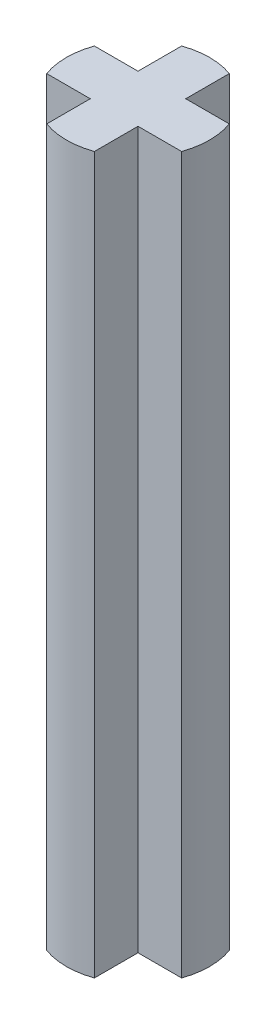
ISO-10303-21;
HEADER;
FILE_DESCRIPTION(('STEP AP214'),'2;1');
FILE_NAME('part.step','',(''),(''),'','','');
FILE_SCHEMA(('AUTOMOTIVE_DESIGN { 1 0 10303 214 1 1 1 1 }'));
ENDSEC;
DATA;
#1=APPLICATION_CONTEXT('core data for automotive mechanical design processes');
#2=APPLICATION_PROTOCOL_DEFINITION('international standard','automotive_design',2000,#1);
#3=PRODUCT_CONTEXT('',#1,'mechanical');
#4=PRODUCT('Part','Part','',(#3));
#5=PRODUCT_RELATED_PRODUCT_CATEGORY('part','',(#4));
#6=PRODUCT_DEFINITION_FORMATION('','',#4);
#7=PRODUCT_DEFINITION_CONTEXT('part definition',#1,'design');
#8=PRODUCT_DEFINITION('design','',#6,#7);
#9=PRODUCT_DEFINITION_SHAPE('','',#8);
#10=(LENGTH_UNIT() NAMED_UNIT(*) SI_UNIT(.MILLI.,.METRE.));
#11=(NAMED_UNIT(*) PLANE_ANGLE_UNIT() SI_UNIT($,.RADIAN.));
#12=(NAMED_UNIT(*) SI_UNIT($,.STERADIAN.) SOLID_ANGLE_UNIT());
#13=UNCERTAINTY_MEASURE_WITH_UNIT(LENGTH_MEASURE(1.E-05),#10,'distance_accuracy_value','');
#14=(GEOMETRIC_REPRESENTATION_CONTEXT(3) GLOBAL_UNCERTAINTY_ASSIGNED_CONTEXT((#13)) GLOBAL_UNIT_ASSIGNED_CONTEXT((#10,
#11,#12)) REPRESENTATION_CONTEXT('',''));
#15=CARTESIAN_POINT('',(0.,0.,0.));
#16=DIRECTION('',(0.,0.,1.));
#17=DIRECTION('',(1.,0.,0.));
#18=AXIS2_PLACEMENT_3D('',#15,#16,#17);
#19=CARTESIAN_POINT('',(-1.5,15.,0.5));
#20=DIRECTION('',(0.,0.,-1.));
#21=DIRECTION('',(-1.,0.,0.));
#22=AXIS2_PLACEMENT_3D('',#19,#20,#21);
#23=PLANE('',#22);
#24=DIRECTION('',(0.,1.,0.));
#25=VECTOR('',#24,1.);
#26=CARTESIAN_POINT('',(-1.41421356237309,-0.000999999999999265,0.5));
#27=LINE('',#26,#25);
#28=CARTESIAN_POINT('',(-1.4142135623731,15.,0.5));
#29=VERTEX_POINT('',#28);
#30=CARTESIAN_POINT('',(-1.4142135623731,0.,0.5));
#31=VERTEX_POINT('',#30);
#32=EDGE_CURVE('E243',#29,#31,#27,.F.);
#33=ORIENTED_EDGE('',*,*,#32,.T.);
#34=DIRECTION('',(1.,0.,0.));
#35=VECTOR('',#34,1.);
#36=CARTESIAN_POINT('',(-1.5,0.,0.5));
#37=LINE('',#36,#35);
#38=CARTESIAN_POINT('',(-0.5,0.,0.5));
#39=VERTEX_POINT('',#38);
#40=EDGE_CURVE('E211',#31,#39,#37,.T.);
#41=ORIENTED_EDGE('',*,*,#40,.T.);
#42=DIRECTION('',(0.,1.,0.));
#43=VECTOR('',#42,1.);
#44=CARTESIAN_POINT('',(-0.5,15.,0.5));
#45=LINE('',#44,#43);
#46=CARTESIAN_POINT('',(-0.5,15.,0.5));
#47=VERTEX_POINT('',#46);
#48=EDGE_CURVE('E65',#39,#47,#45,.T.);
#49=ORIENTED_EDGE('',*,*,#48,.T.);
#50=DIRECTION('',(1.,0.,0.));
#51=VECTOR('',#50,1.);
#52=CARTESIAN_POINT('',(-1.5,15.,0.5));
#53=LINE('',#52,#51);
#54=EDGE_CURVE('E206',#29,#47,#53,.T.);
#55=ORIENTED_EDGE('',*,*,#54,.F.);
#56=EDGE_LOOP('',(#33,#41,#49,#55));
#57=FACE_BOUND('',#56,.T.);
#58=ADVANCED_FACE('F57',(#57),#23,.F.);
#59=CARTESIAN_POINT('',(-1.5,15.,-0.5));
#60=DIRECTION('',(0.,0.,-1.));
#61=DIRECTION('',(-1.,0.,0.));
#62=AXIS2_PLACEMENT_3D('',#59,#60,#61);
#63=PLANE('',#62);
#64=DIRECTION('',(1.,0.,0.));
#65=VECTOR('',#64,1.);
#66=CARTESIAN_POINT('',(-1.5,0.,-0.5));
#67=LINE('',#66,#65);
#68=CARTESIAN_POINT('',(-1.4142135623731,0.,-0.5));
#69=VERTEX_POINT('',#68);
#70=CARTESIAN_POINT('',(-0.5,0.,-0.5));
#71=VERTEX_POINT('',#70);
#72=EDGE_CURVE('E214',#69,#71,#67,.T.);
#73=ORIENTED_EDGE('',*,*,#72,.F.);
#74=DIRECTION('',(0.,1.,0.));
#75=VECTOR('',#74,1.);
#76=CARTESIAN_POINT('',(-1.41421356237309,-0.000999999999999265,-0.5));
#77=LINE('',#76,#75);
#78=CARTESIAN_POINT('',(-1.4142135623731,15.,-0.5));
#79=VERTEX_POINT('',#78);
#80=EDGE_CURVE('E240',#79,#69,#77,.F.);
#81=ORIENTED_EDGE('',*,*,#80,.F.);
#82=DIRECTION('',(1.,0.,0.));
#83=VECTOR('',#82,1.);
#84=CARTESIAN_POINT('',(-1.5,15.,-0.5));
#85=LINE('',#84,#83);
#86=CARTESIAN_POINT('',(-0.5,15.,-0.5));
#87=VERTEX_POINT('',#86);
#88=EDGE_CURVE('E187',#79,#87,#85,.T.);
#89=ORIENTED_EDGE('',*,*,#88,.T.);
#90=DIRECTION('',(0.,1.,0.));
#91=VECTOR('',#90,1.);
#92=CARTESIAN_POINT('',(-0.5,15.,-0.5));
#93=LINE('',#92,#91);
#94=EDGE_CURVE('E183',#71,#87,#93,.T.);
#95=ORIENTED_EDGE('',*,*,#94,.F.);
#96=EDGE_LOOP('',(#73,#81,#89,#95));
#97=FACE_BOUND('',#96,.T.);
#98=ADVANCED_FACE('F259',(#97),#63,.T.);
#99=CARTESIAN_POINT('',(0.,0.,0.));
#100=DIRECTION('',(0.,1.,0.));
#101=DIRECTION('',(0.,0.,1.));
#102=AXIS2_PLACEMENT_3D('',#99,#100,#101);
#103=PLANE('',#102);
#104=CARTESIAN_POINT('',(0.,0.,0.));
#105=DIRECTION('',(0.,1.,0.));
#106=DIRECTION('',(0.,0.,1.));
#107=AXIS2_PLACEMENT_3D('',#104,#105,#106);
#108=CIRCLE('',#107,1.5);
#109=EDGE_CURVE('E162',#31,#69,#108,.F.);
#110=ORIENTED_EDGE('',*,*,#109,.T.);
#111=ORIENTED_EDGE('',*,*,#72,.T.);
#112=DIRECTION('',(0.,0.,-1.));
#113=VECTOR('',#112,1.);
#114=CARTESIAN_POINT('',(-0.5,0.,1.5));
#115=LINE('',#114,#113);
#116=CARTESIAN_POINT('',(-0.5,0.,-1.4142135623731));
#117=VERTEX_POINT('',#116);
#118=EDGE_CURVE('E174',#71,#117,#115,.T.);
#119=ORIENTED_EDGE('',*,*,#118,.T.);
#120=CARTESIAN_POINT('',(0.5,0.,-1.41421356237309));
#121=VERTEX_POINT('',#120);
#122=EDGE_CURVE('E159',#117,#121,#108,.F.);
#123=ORIENTED_EDGE('',*,*,#122,.T.);
#124=DIRECTION('',(0.,0.,-1.));
#125=VECTOR('',#124,1.);
#126=CARTESIAN_POINT('',(0.5,0.,1.5));
#127=LINE('',#126,#125);
#128=CARTESIAN_POINT('',(0.5,0.,-0.5));
#129=VERTEX_POINT('',#128);
#130=EDGE_CURVE('E253',#129,#121,#127,.T.);
#131=ORIENTED_EDGE('',*,*,#130,.F.);
#132=CARTESIAN_POINT('',(1.41421356237309,0.,-0.5));
#133=VERTEX_POINT('',#132);
#134=EDGE_CURVE('E196',#129,#133,#67,.T.);
#135=ORIENTED_EDGE('',*,*,#134,.T.);
#136=CARTESIAN_POINT('',(1.41421356237309,0.,0.5));
#137=VERTEX_POINT('',#136);
#138=EDGE_CURVE('E80',#133,#137,#108,.F.);
#139=ORIENTED_EDGE('',*,*,#138,.T.);
#140=CARTESIAN_POINT('',(0.5,0.,0.5));
#141=VERTEX_POINT('',#140);
#142=EDGE_CURVE('E213',#141,#137,#37,.T.);
#143=ORIENTED_EDGE('',*,*,#142,.F.);
#144=CARTESIAN_POINT('',(0.5,0.,1.41421356237309));
#145=VERTEX_POINT('',#144);
#146=EDGE_CURVE('E155',#145,#141,#127,.T.);
#147=ORIENTED_EDGE('',*,*,#146,.F.);
#148=CARTESIAN_POINT('',(-0.5,0.,1.4142135623731));
#149=VERTEX_POINT('',#148);
#150=EDGE_CURVE('E147',#145,#149,#108,.F.);
#151=ORIENTED_EDGE('',*,*,#150,.T.);
#152=EDGE_CURVE('E152',#149,#39,#115,.T.);
#153=ORIENTED_EDGE('',*,*,#152,.T.);
#154=ORIENTED_EDGE('',*,*,#40,.F.);
#155=EDGE_LOOP('',(#110,#111,#119,#123,#131,#135,#139,#143,#147,#151,#153,#154));
#156=FACE_BOUND('',#155,.T.);
#157=ADVANCED_FACE('F149',(#156),#103,.F.);
#158=CARTESIAN_POINT('',(0.,15.,0.));
#159=DIRECTION('',(0.,1.,0.));
#160=DIRECTION('',(0.,0.,1.));
#161=AXIS2_PLACEMENT_3D('',#158,#159,#160);
#162=PLANE('',#161);
#163=ORIENTED_EDGE('',*,*,#88,.F.);
#164=CARTESIAN_POINT('',(0.,15.,0.));
#165=DIRECTION('',(0.,1.,0.));
#166=DIRECTION('',(0.,0.,1.));
#167=AXIS2_PLACEMENT_3D('',#164,#165,#166);
#168=CIRCLE('',#167,1.5);
#169=EDGE_CURVE('E72',#79,#29,#168,.T.);
#170=ORIENTED_EDGE('',*,*,#169,.T.);
#171=ORIENTED_EDGE('',*,*,#54,.T.);
#172=DIRECTION('',(0.,0.,-1.));
#173=VECTOR('',#172,1.);
#174=CARTESIAN_POINT('',(-0.5,15.,1.5));
#175=LINE('',#174,#173);
#176=CARTESIAN_POINT('',(-0.5,15.,1.4142135623731));
#177=VERTEX_POINT('',#176);
#178=EDGE_CURVE('E216',#177,#47,#175,.T.);
#179=ORIENTED_EDGE('',*,*,#178,.F.);
#180=CARTESIAN_POINT('',(0.5,15.,1.4142135623731));
#181=VERTEX_POINT('',#180);
#182=EDGE_CURVE('E160',#177,#181,#168,.T.);
#183=ORIENTED_EDGE('',*,*,#182,.T.);
#184=DIRECTION('',(0.,0.,-1.));
#185=VECTOR('',#184,1.);
#186=CARTESIAN_POINT('',(0.5,15.,1.5));
#187=LINE('',#186,#185);
#188=CARTESIAN_POINT('',(0.5,15.,0.5));
#189=VERTEX_POINT('',#188);
#190=EDGE_CURVE('E177',#181,#189,#187,.T.);
#191=ORIENTED_EDGE('',*,*,#190,.T.);
#192=CARTESIAN_POINT('',(1.41421356237309,15.,0.5));
#193=VERTEX_POINT('',#192);
#194=EDGE_CURVE('E208',#189,#193,#53,.T.);
#195=ORIENTED_EDGE('',*,*,#194,.T.);
#196=CARTESIAN_POINT('',(1.41421356237309,15.,-0.5));
#197=VERTEX_POINT('',#196);
#198=EDGE_CURVE('E205',#193,#197,#168,.T.);
#199=ORIENTED_EDGE('',*,*,#198,.T.);
#200=CARTESIAN_POINT('',(0.5,15.,-0.5));
#201=VERTEX_POINT('',#200);
#202=EDGE_CURVE('E194',#201,#197,#85,.T.);
#203=ORIENTED_EDGE('',*,*,#202,.F.);
#204=CARTESIAN_POINT('',(0.5,15.,-1.4142135623731));
#205=VERTEX_POINT('',#204);
#206=EDGE_CURVE('E173',#201,#205,#187,.T.);
#207=ORIENTED_EDGE('',*,*,#206,.T.);
#208=CARTESIAN_POINT('',(-0.5,15.,-1.4142135623731));
#209=VERTEX_POINT('',#208);
#210=EDGE_CURVE('E227',#205,#209,#168,.T.);
#211=ORIENTED_EDGE('',*,*,#210,.T.);
#212=EDGE_CURVE('E215',#87,#209,#175,.T.);
#213=ORIENTED_EDGE('',*,*,#212,.F.);
#214=EDGE_LOOP('',(#163,#170,#171,#179,#183,#191,#195,#199,#203,#207,#211,#213));
#215=FACE_BOUND('',#214,.T.);
#216=ADVANCED_FACE('F203',(#215),#162,.T.);
#217=DIRECTION('',(0.,1.,0.));
#218=VECTOR('',#217,1.);
#219=CARTESIAN_POINT('',(1.41421356237309,-0.000999999999999265,0.5));
#220=LINE('',#219,#218);
#221=EDGE_CURVE('E237',#137,#193,#220,.T.);
#222=ORIENTED_EDGE('',*,*,#221,.T.);
#223=ORIENTED_EDGE('',*,*,#194,.F.);
#224=DIRECTION('',(0.,1.,0.));
#225=VECTOR('',#224,1.);
#226=CARTESIAN_POINT('',(0.5,15.,0.5));
#227=LINE('',#226,#225);
#228=EDGE_CURVE('E12',#141,#189,#227,.T.);
#229=ORIENTED_EDGE('',*,*,#228,.F.);
#230=ORIENTED_EDGE('',*,*,#142,.T.);
#231=EDGE_LOOP('',(#222,#223,#229,#230));
#232=FACE_BOUND('',#231,.T.);
#233=ADVANCED_FACE('F251',(#232),#23,.F.);
#234=ORIENTED_EDGE('',*,*,#202,.T.);
#235=DIRECTION('',(0.,1.,0.));
#236=VECTOR('',#235,1.);
#237=CARTESIAN_POINT('',(1.41421356237309,-0.000999999999999265,-0.5));
#238=LINE('',#237,#236);
#239=EDGE_CURVE('E232',#133,#197,#238,.T.);
#240=ORIENTED_EDGE('',*,*,#239,.F.);
#241=ORIENTED_EDGE('',*,*,#134,.F.);
#242=DIRECTION('',(0.,1.,0.));
#243=VECTOR('',#242,1.);
#244=CARTESIAN_POINT('',(0.5,15.,-0.5));
#245=LINE('',#244,#243);
#246=EDGE_CURVE('E186',#129,#201,#245,.T.);
#247=ORIENTED_EDGE('',*,*,#246,.T.);
#248=EDGE_LOOP('',(#234,#240,#241,#247));
#249=FACE_BOUND('',#248,.T.);
#250=ADVANCED_FACE('F192',(#249),#63,.T.);
#251=CARTESIAN_POINT('',(0.5,15.,1.5));
#252=DIRECTION('',(-1.,0.,0.));
#253=DIRECTION('',(0.,0.,1.));
#254=AXIS2_PLACEMENT_3D('',#251,#252,#253);
#255=PLANE('',#254);
#256=DIRECTION('',(0.,1.,0.));
#257=VECTOR('',#256,1.);
#258=CARTESIAN_POINT('',(0.5,-0.000999999999999265,-1.41421356237309));
#259=LINE('',#258,#257);
#260=EDGE_CURVE('E202',#121,#205,#259,.T.);
#261=ORIENTED_EDGE('',*,*,#260,.T.);
#262=ORIENTED_EDGE('',*,*,#206,.F.);
#263=ORIENTED_EDGE('',*,*,#246,.F.);
#264=ORIENTED_EDGE('',*,*,#130,.T.);
#265=EDGE_LOOP('',(#261,#262,#263,#264));
#266=FACE_BOUND('',#265,.T.);
#267=ADVANCED_FACE('F59',(#266),#255,.F.);
#268=CARTESIAN_POINT('',(-0.5,15.,1.5));
#269=DIRECTION('',(-1.,0.,0.));
#270=DIRECTION('',(0.,0.,1.));
#271=AXIS2_PLACEMENT_3D('',#268,#269,#270);
#272=PLANE('',#271);
#273=ORIENTED_EDGE('',*,*,#212,.T.);
#274=DIRECTION('',(0.,1.,0.));
#275=VECTOR('',#274,1.);
#276=CARTESIAN_POINT('',(-0.5,-0.000999999999999265,-1.4142135623731));
#277=LINE('',#276,#275);
#278=EDGE_CURVE('E225',#117,#209,#277,.T.);
#279=ORIENTED_EDGE('',*,*,#278,.F.);
#280=ORIENTED_EDGE('',*,*,#118,.F.);
#281=ORIENTED_EDGE('',*,*,#94,.T.);
#282=EDGE_LOOP('',(#273,#279,#280,#281));
#283=FACE_BOUND('',#282,.T.);
#284=ADVANCED_FACE('F222',(#283),#272,.T.);
#285=DIRECTION('',(0.,1.,0.));
#286=VECTOR('',#285,1.);
#287=CARTESIAN_POINT('',(0.5,-0.000999999999999265,1.41421356237309));
#288=LINE('',#287,#286);
#289=EDGE_CURVE('E169',#181,#145,#288,.F.);
#290=ORIENTED_EDGE('',*,*,#289,.T.);
#291=ORIENTED_EDGE('',*,*,#146,.T.);
#292=ORIENTED_EDGE('',*,*,#228,.T.);
#293=ORIENTED_EDGE('',*,*,#190,.F.);
#294=EDGE_LOOP('',(#290,#291,#292,#293));
#295=FACE_BOUND('',#294,.T.);
#296=ADVANCED_FACE('F247',(#295),#255,.F.);
#297=ORIENTED_EDGE('',*,*,#152,.F.);
#298=DIRECTION('',(0.,1.,0.));
#299=VECTOR('',#298,1.);
#300=CARTESIAN_POINT('',(-0.5,-0.000999999999999265,1.4142135623731));
#301=LINE('',#300,#299);
#302=EDGE_CURVE('E164',#177,#149,#301,.F.);
#303=ORIENTED_EDGE('',*,*,#302,.F.);
#304=ORIENTED_EDGE('',*,*,#178,.T.);
#305=ORIENTED_EDGE('',*,*,#48,.F.);
#306=EDGE_LOOP('',(#297,#303,#304,#305));
#307=FACE_BOUND('',#306,.T.);
#308=ADVANCED_FACE('F171',(#307),#272,.T.);
#309=CARTESIAN_POINT('',(0.,-0.000999999999999265,0.));
#310=DIRECTION('',(0.,1.,0.));
#311=DIRECTION('',(0.,0.,1.));
#312=AXIS2_PLACEMENT_3D('',#309,#310,#311);
#313=CYLINDRICAL_SURFACE('',#312,1.5);
#314=ORIENTED_EDGE('',*,*,#302,.T.);
#315=ORIENTED_EDGE('',*,*,#150,.F.);
#316=ORIENTED_EDGE('',*,*,#289,.F.);
#317=ORIENTED_EDGE('',*,*,#182,.F.);
#318=EDGE_LOOP('',(#314,#315,#316,#317));
#319=FACE_BOUND('',#318,.T.);
#320=ADVANCED_FACE('F165',(#319),#313,.T.);
#321=ORIENTED_EDGE('',*,*,#260,.F.);
#322=ORIENTED_EDGE('',*,*,#122,.F.);
#323=ORIENTED_EDGE('',*,*,#278,.T.);
#324=ORIENTED_EDGE('',*,*,#210,.F.);
#325=EDGE_LOOP('',(#321,#322,#323,#324));
#326=FACE_BOUND('',#325,.T.);
#327=ADVANCED_FACE('F230',(#326),#313,.T.);
#328=ORIENTED_EDGE('',*,*,#221,.F.);
#329=ORIENTED_EDGE('',*,*,#138,.F.);
#330=ORIENTED_EDGE('',*,*,#239,.T.);
#331=ORIENTED_EDGE('',*,*,#198,.F.);
#332=EDGE_LOOP('',(#328,#329,#330,#331));
#333=FACE_BOUND('',#332,.T.);
#334=ADVANCED_FACE('F252',(#333),#313,.T.);
#335=ORIENTED_EDGE('',*,*,#80,.T.);
#336=ORIENTED_EDGE('',*,*,#109,.F.);
#337=ORIENTED_EDGE('',*,*,#32,.F.);
#338=ORIENTED_EDGE('',*,*,#169,.F.);
#339=EDGE_LOOP('',(#335,#336,#337,#338));
#340=FACE_BOUND('',#339,.T.);
#341=ADVANCED_FACE('F257',(#340),#313,.T.);
#342=CLOSED_SHELL('',(#58,#98,#157,#216,#233,#250,#267,#284,#296,#308,#320,#327,#334,#341));
#343=MANIFOLD_SOLID_BREP('B2',#342);
#344=ADVANCED_BREP_SHAPE_REPRESENTATION('',(#18,#343),#14);
#345=SHAPE_DEFINITION_REPRESENTATION(#9,#344);
ENDSEC;
END-ISO-10303-21;
